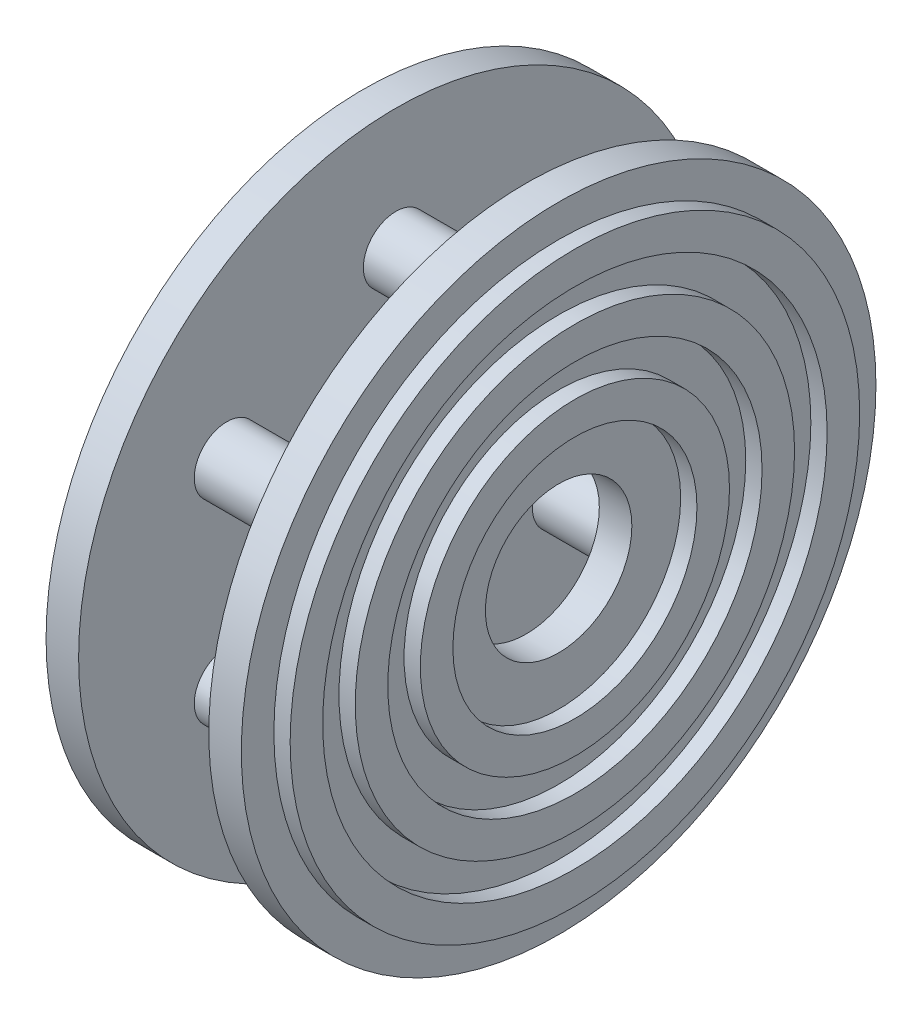
ISO-10303-21;
HEADER;
FILE_DESCRIPTION(('STEP AP214'),'2;1');
FILE_NAME('part.step','',(''),(''),'','','');
FILE_SCHEMA(('AUTOMOTIVE_DESIGN { 1 0 10303 214 1 1 1 1 }'));
ENDSEC;
DATA;
#1=APPLICATION_CONTEXT('core data for automotive mechanical design processes');
#2=APPLICATION_PROTOCOL_DEFINITION('international standard','automotive_design',2000,#1);
#3=PRODUCT_CONTEXT('',#1,'mechanical');
#4=PRODUCT('Part','Part','',(#3));
#5=PRODUCT_RELATED_PRODUCT_CATEGORY('part','',(#4));
#6=PRODUCT_DEFINITION_FORMATION('','',#4);
#7=PRODUCT_DEFINITION_CONTEXT('part definition',#1,'design');
#8=PRODUCT_DEFINITION('design','',#6,#7);
#9=PRODUCT_DEFINITION_SHAPE('','',#8);
#10=(LENGTH_UNIT() NAMED_UNIT(*) SI_UNIT(.MILLI.,.METRE.));
#11=(NAMED_UNIT(*) PLANE_ANGLE_UNIT() SI_UNIT($,.RADIAN.));
#12=(NAMED_UNIT(*) SI_UNIT($,.STERADIAN.) SOLID_ANGLE_UNIT());
#13=UNCERTAINTY_MEASURE_WITH_UNIT(LENGTH_MEASURE(1.E-05),#10,'distance_accuracy_value','');
#14=(GEOMETRIC_REPRESENTATION_CONTEXT(3) GLOBAL_UNCERTAINTY_ASSIGNED_CONTEXT((#13)) GLOBAL_UNIT_ASSIGNED_CONTEXT((#10,
#11,#12)) REPRESENTATION_CONTEXT('',''));
#15=CARTESIAN_POINT('',(0.,0.,0.));
#16=DIRECTION('',(0.,0.,1.));
#17=DIRECTION('',(1.,0.,0.));
#18=AXIS2_PLACEMENT_3D('',#15,#16,#17);
#19=CARTESIAN_POINT('',(1.,0.,0.));
#20=DIRECTION('',(1.,0.,0.));
#21=DIRECTION('',(0.,0.,-1.));
#22=AXIS2_PLACEMENT_3D('',#19,#20,#21);
#23=PLANE('',#22);
#24=CARTESIAN_POINT('',(1.,0.,0.));
#25=DIRECTION('',(1.,0.,0.));
#26=DIRECTION('',(0.,0.,-1.));
#27=AXIS2_PLACEMENT_3D('',#24,#25,#26);
#28=CIRCLE('',#27,2.25);
#29=CARTESIAN_POINT('',(1.,0.,-2.25));
#30=VERTEX_POINT('',#29);
#31=EDGE_CURVE('E90',#30,#30,#28,.T.);
#32=ORIENTED_EDGE('',*,*,#31,.F.);
#33=EDGE_LOOP('',(#32));
#34=FACE_BOUND('',#33,.T.);
#35=CARTESIAN_POINT('',(1.,0.,0.));
#36=DIRECTION('',(1.,0.,0.));
#37=DIRECTION('',(0.,0.,-1.));
#38=AXIS2_PLACEMENT_3D('',#35,#36,#37);
#39=CIRCLE('',#38,3.75);
#40=CARTESIAN_POINT('',(1.,0.,-3.75));
#41=VERTEX_POINT('',#40);
#42=EDGE_CURVE('E77',#41,#41,#39,.F.);
#43=ORIENTED_EDGE('',*,*,#42,.F.);
#44=EDGE_LOOP('',(#43));
#45=FACE_BOUND('',#44,.T.);
#46=ADVANCED_FACE('F51',(#34,#45),#23,.T.);
#47=CARTESIAN_POINT('',(1.,0.,0.));
#48=DIRECTION('',(1.,0.,0.));
#49=DIRECTION('',(0.,0.,-1.));
#50=AXIS2_PLACEMENT_3D('',#47,#48,#49);
#51=CIRCLE('',#50,4.75);
#52=CARTESIAN_POINT('',(1.,0.,-4.75));
#53=VERTEX_POINT('',#52);
#54=EDGE_CURVE('E117',#53,#53,#51,.T.);
#55=ORIENTED_EDGE('',*,*,#54,.F.);
#56=EDGE_LOOP('',(#55));
#57=FACE_BOUND('',#56,.T.);
#58=CARTESIAN_POINT('',(1.,0.,0.));
#59=DIRECTION('',(1.,0.,0.));
#60=DIRECTION('',(0.,0.,-1.));
#61=AXIS2_PLACEMENT_3D('',#58,#59,#60);
#62=CIRCLE('',#61,5.75);
#63=CARTESIAN_POINT('',(1.,0.,-5.75));
#64=VERTEX_POINT('',#63);
#65=EDGE_CURVE('E80',#64,#64,#62,.F.);
#66=ORIENTED_EDGE('',*,*,#65,.F.);
#67=EDGE_LOOP('',(#66));
#68=FACE_BOUND('',#67,.T.);
#69=ADVANCED_FACE('F177',(#57,#68),#23,.T.);
#70=CARTESIAN_POINT('',(1.,0.,0.));
#71=DIRECTION('',(1.,0.,0.));
#72=DIRECTION('',(0.,0.,-1.));
#73=AXIS2_PLACEMENT_3D('',#70,#71,#72);
#74=CIRCLE('',#73,6.75);
#75=CARTESIAN_POINT('',(1.,0.,-6.75));
#76=VERTEX_POINT('',#75);
#77=EDGE_CURVE('E108',#76,#76,#74,.T.);
#78=ORIENTED_EDGE('',*,*,#77,.F.);
#79=EDGE_LOOP('',(#78));
#80=FACE_BOUND('',#79,.T.);
#81=CARTESIAN_POINT('',(1.,0.,0.));
#82=DIRECTION('',(1.,0.,0.));
#83=DIRECTION('',(0.,0.,-1.));
#84=AXIS2_PLACEMENT_3D('',#81,#82,#83);
#85=CIRCLE('',#84,7.75);
#86=CARTESIAN_POINT('',(1.,0.,-7.75));
#87=VERTEX_POINT('',#86);
#88=EDGE_CURVE('E83',#87,#87,#85,.F.);
#89=ORIENTED_EDGE('',*,*,#88,.F.);
#90=EDGE_LOOP('',(#89));
#91=FACE_BOUND('',#90,.T.);
#92=ADVANCED_FACE('F184',(#80,#91),#23,.T.);
#93=CARTESIAN_POINT('',(1.,0.,0.));
#94=DIRECTION('',(1.,0.,0.));
#95=DIRECTION('',(0.,0.,-1.));
#96=AXIS2_PLACEMENT_3D('',#93,#94,#95);
#97=CIRCLE('',#96,8.75);
#98=CARTESIAN_POINT('',(1.,0.,-8.75));
#99=VERTEX_POINT('',#98);
#100=EDGE_CURVE('E99',#99,#99,#97,.T.);
#101=ORIENTED_EDGE('',*,*,#100,.F.);
#102=EDGE_LOOP('',(#101));
#103=FACE_BOUND('',#102,.T.);
#104=CARTESIAN_POINT('',(1.,0.,0.));
#105=DIRECTION('',(1.,0.,0.));
#106=DIRECTION('',(0.,0.,-1.));
#107=AXIS2_PLACEMENT_3D('',#104,#105,#106);
#108=CIRCLE('',#107,9.75);
#109=CARTESIAN_POINT('',(1.,0.,-9.75));
#110=VERTEX_POINT('',#109);
#111=EDGE_CURVE('E86',#110,#110,#108,.T.);
#112=ORIENTED_EDGE('',*,*,#111,.T.);
#113=EDGE_LOOP('',(#112));
#114=FACE_BOUND('',#113,.T.);
#115=ADVANCED_FACE('F180',(#103,#114),#23,.T.);
#116=CARTESIAN_POINT('',(0.,0.,0.));
#117=DIRECTION('',(1.,0.,0.));
#118=DIRECTION('',(0.,0.,-1.));
#119=AXIS2_PLACEMENT_3D('',#116,#117,#118);
#120=PLANE('',#119);
#121=CARTESIAN_POINT('',(0.,3.00000000000022,5.19615242270676));
#122=DIRECTION('',(1.,0.,0.));
#123=DIRECTION('',(0.,0.,-1.));
#124=AXIS2_PLACEMENT_3D('',#121,#122,#123);
#125=CIRCLE('',#124,1.00000000000007);
#126=CARTESIAN_POINT('',(0.,3.00000000000022,4.19615242270669));
#127=VERTEX_POINT('',#126);
#128=EDGE_CURVE('E11',#127,#127,#125,.F.);
#129=ORIENTED_EDGE('',*,*,#128,.F.);
#130=EDGE_LOOP('',(#129));
#131=FACE_BOUND('',#130,.T.);
#132=CARTESIAN_POINT('',(0.,-2.99999999999978,5.19615242270701));
#133=DIRECTION('',(1.,0.,0.));
#134=DIRECTION('',(0.,0.,-1.));
#135=AXIS2_PLACEMENT_3D('',#132,#133,#134);
#136=CIRCLE('',#135,1.00000000000033);
#137=CARTESIAN_POINT('',(0.,-2.99999999999978,4.19615242270669));
#138=VERTEX_POINT('',#137);
#139=EDGE_CURVE('E58',#138,#138,#136,.F.);
#140=ORIENTED_EDGE('',*,*,#139,.F.);
#141=EDGE_LOOP('',(#140));
#142=FACE_BOUND('',#141,.T.);
#143=CARTESIAN_POINT('',(0.,-6.,5.09386405508807E-13));
#144=DIRECTION('',(1.,0.,0.));
#145=DIRECTION('',(0.,0.,-1.));
#146=AXIS2_PLACEMENT_3D('',#143,#144,#145);
#147=CIRCLE('',#146,1.00000000000053);
#148=CARTESIAN_POINT('',(0.,-6.,-1.00000000000002));
#149=VERTEX_POINT('',#148);
#150=EDGE_CURVE('E62',#149,#149,#147,.F.);
#151=ORIENTED_EDGE('',*,*,#150,.F.);
#152=EDGE_LOOP('',(#151));
#153=FACE_BOUND('',#152,.T.);
#154=CARTESIAN_POINT('',(0.,-3.00000000000022,-5.19615242270625));
#155=DIRECTION('',(1.,0.,0.));
#156=DIRECTION('',(0.,0.,-1.));
#157=AXIS2_PLACEMENT_3D('',#154,#155,#156);
#158=CIRCLE('',#157,1.00000000000048);
#159=CARTESIAN_POINT('',(0.,-3.00000000000022,-6.19615242270674));
#160=VERTEX_POINT('',#159);
#161=EDGE_CURVE('E66',#160,#160,#158,.F.);
#162=ORIENTED_EDGE('',*,*,#161,.F.);
#163=EDGE_LOOP('',(#162));
#164=FACE_BOUND('',#163,.T.);
#165=CARTESIAN_POINT('',(0.,2.99999999999978,-5.19615242270651));
#166=DIRECTION('',(1.,0.,0.));
#167=DIRECTION('',(0.,0.,-1.));
#168=AXIS2_PLACEMENT_3D('',#165,#166,#167);
#169=CIRCLE('',#168,1.00000000000026);
#170=CARTESIAN_POINT('',(0.,2.99999999999978,-6.19615242270677));
#171=VERTEX_POINT('',#170);
#172=EDGE_CURVE('E71',#171,#171,#169,.F.);
#173=ORIENTED_EDGE('',*,*,#172,.F.);
#174=EDGE_LOOP('',(#173));
#175=FACE_BOUND('',#174,.T.);
#176=CARTESIAN_POINT('',(0.,6.,0.));
#177=DIRECTION('',(1.,0.,0.));
#178=DIRECTION('',(0.,0.,-1.));
#179=AXIS2_PLACEMENT_3D('',#176,#177,#178);
#180=CIRCLE('',#179,1.);
#181=CARTESIAN_POINT('',(0.,6.,-1.));
#182=VERTEX_POINT('',#181);
#183=EDGE_CURVE('E74',#182,#182,#180,.F.);
#184=ORIENTED_EDGE('',*,*,#183,.F.);
#185=EDGE_LOOP('',(#184));
#186=FACE_BOUND('',#185,.T.);
#187=CARTESIAN_POINT('',(0.,0.,0.));
#188=DIRECTION('',(1.,0.,0.));
#189=DIRECTION('',(0.,0.,-1.));
#190=AXIS2_PLACEMENT_3D('',#187,#188,#189);
#191=CIRCLE('',#190,9.75);
#192=CARTESIAN_POINT('',(0.,0.,-9.75));
#193=VERTEX_POINT('',#192);
#194=EDGE_CURVE('E87',#193,#193,#191,.T.);
#195=ORIENTED_EDGE('',*,*,#194,.F.);
#196=EDGE_LOOP('',(#195));
#197=FACE_BOUND('',#196,.T.);
#198=CARTESIAN_POINT('',(0.,0.,0.));
#199=DIRECTION('',(1.,0.,0.));
#200=DIRECTION('',(0.,0.,-1.));
#201=AXIS2_PLACEMENT_3D('',#198,#199,#200);
#202=CIRCLE('',#201,2.25);
#203=CARTESIAN_POINT('',(0.,0.,-2.25));
#204=VERTEX_POINT('',#203);
#205=EDGE_CURVE('E93',#204,#204,#202,.T.);
#206=ORIENTED_EDGE('',*,*,#205,.T.);
#207=EDGE_LOOP('',(#206));
#208=FACE_BOUND('',#207,.T.);
#209=ADVANCED_FACE('F190',(#131,#142,#153,#164,#175,#186,#197,#208),#120,.F.);
#210=CARTESIAN_POINT('',(1.,0.,0.));
#211=DIRECTION('',(-1.,0.,0.));
#212=DIRECTION('',(0.,0.,1.));
#213=AXIS2_PLACEMENT_3D('',#210,#211,#212);
#214=CYLINDRICAL_SURFACE('',#213,9.75);
#215=ORIENTED_EDGE('',*,*,#111,.F.);
#216=EDGE_LOOP('',(#215));
#217=FACE_BOUND('',#216,.T.);
#218=ORIENTED_EDGE('',*,*,#194,.T.);
#219=EDGE_LOOP('',(#218));
#220=FACE_BOUND('',#219,.T.);
#221=ADVANCED_FACE('F53',(#217,#220),#214,.T.);
#222=CARTESIAN_POINT('',(1.,0.,0.));
#223=DIRECTION('',(-1.,0.,0.));
#224=DIRECTION('',(0.,0.,1.));
#225=AXIS2_PLACEMENT_3D('',#222,#223,#224);
#226=CYLINDRICAL_SURFACE('',#225,2.25);
#227=ORIENTED_EDGE('',*,*,#31,.T.);
#228=EDGE_LOOP('',(#227));
#229=FACE_BOUND('',#228,.T.);
#230=ORIENTED_EDGE('',*,*,#205,.F.);
#231=EDGE_LOOP('',(#230));
#232=FACE_BOUND('',#231,.T.);
#233=ADVANCED_FACE('F204',(#229,#232),#226,.F.);
#234=CARTESIAN_POINT('',(1.5,0.,0.));
#235=DIRECTION('',(-1.,0.,0.));
#236=DIRECTION('',(0.,0.,1.));
#237=AXIS2_PLACEMENT_3D('',#234,#235,#236);
#238=CYLINDRICAL_SURFACE('',#237,7.75);
#239=CARTESIAN_POINT('',(1.5,0.,0.));
#240=DIRECTION('',(1.,0.,0.));
#241=DIRECTION('',(0.,0.,-1.));
#242=AXIS2_PLACEMENT_3D('',#239,#240,#241);
#243=CIRCLE('',#242,7.75);
#244=CARTESIAN_POINT('',(1.5,0.,-7.75));
#245=VERTEX_POINT('',#244);
#246=EDGE_CURVE('E102',#245,#245,#243,.T.);
#247=ORIENTED_EDGE('',*,*,#246,.T.);
#248=EDGE_LOOP('',(#247));
#249=FACE_BOUND('',#248,.T.);
#250=ORIENTED_EDGE('',*,*,#88,.T.);
#251=EDGE_LOOP('',(#250));
#252=FACE_BOUND('',#251,.T.);
#253=ADVANCED_FACE('F211',(#249,#252),#238,.F.);
#254=CARTESIAN_POINT('',(1.5,0.,0.));
#255=DIRECTION('',(-1.,0.,0.));
#256=DIRECTION('',(0.,0.,1.));
#257=AXIS2_PLACEMENT_3D('',#254,#255,#256);
#258=CYLINDRICAL_SURFACE('',#257,8.75);
#259=CARTESIAN_POINT('',(1.5,0.,0.));
#260=DIRECTION('',(1.,0.,0.));
#261=DIRECTION('',(0.,0.,-1.));
#262=AXIS2_PLACEMENT_3D('',#259,#260,#261);
#263=CIRCLE('',#262,8.75);
#264=CARTESIAN_POINT('',(1.5,0.,-8.75));
#265=VERTEX_POINT('',#264);
#266=EDGE_CURVE('E96',#265,#265,#263,.T.);
#267=ORIENTED_EDGE('',*,*,#266,.F.);
#268=EDGE_LOOP('',(#267));
#269=FACE_BOUND('',#268,.T.);
#270=ORIENTED_EDGE('',*,*,#100,.T.);
#271=EDGE_LOOP('',(#270));
#272=FACE_BOUND('',#271,.T.);
#273=ADVANCED_FACE('F216',(#269,#272),#258,.T.);
#274=CARTESIAN_POINT('',(1.5,0.,0.));
#275=DIRECTION('',(1.,0.,0.));
#276=DIRECTION('',(0.,0.,-1.));
#277=AXIS2_PLACEMENT_3D('',#274,#275,#276);
#278=PLANE('',#277);
#279=ORIENTED_EDGE('',*,*,#246,.F.);
#280=EDGE_LOOP('',(#279));
#281=FACE_BOUND('',#280,.T.);
#282=ORIENTED_EDGE('',*,*,#266,.T.);
#283=EDGE_LOOP('',(#282));
#284=FACE_BOUND('',#283,.T.);
#285=ADVANCED_FACE('F222',(#281,#284),#278,.T.);
#286=CARTESIAN_POINT('',(1.5,0.,0.));
#287=DIRECTION('',(-1.,0.,0.));
#288=DIRECTION('',(0.,0.,1.));
#289=AXIS2_PLACEMENT_3D('',#286,#287,#288);
#290=CYLINDRICAL_SURFACE('',#289,5.75);
#291=CARTESIAN_POINT('',(1.5,0.,0.));
#292=DIRECTION('',(1.,0.,0.));
#293=DIRECTION('',(0.,0.,-1.));
#294=AXIS2_PLACEMENT_3D('',#291,#292,#293);
#295=CIRCLE('',#294,5.75);
#296=CARTESIAN_POINT('',(1.5,0.,-5.75));
#297=VERTEX_POINT('',#296);
#298=EDGE_CURVE('E111',#297,#297,#295,.T.);
#299=ORIENTED_EDGE('',*,*,#298,.T.);
#300=EDGE_LOOP('',(#299));
#301=FACE_BOUND('',#300,.T.);
#302=ORIENTED_EDGE('',*,*,#65,.T.);
#303=EDGE_LOOP('',(#302));
#304=FACE_BOUND('',#303,.T.);
#305=ADVANCED_FACE('F226',(#301,#304),#290,.F.);
#306=CARTESIAN_POINT('',(1.5,0.,0.));
#307=DIRECTION('',(-1.,0.,0.));
#308=DIRECTION('',(0.,0.,1.));
#309=AXIS2_PLACEMENT_3D('',#306,#307,#308);
#310=CYLINDRICAL_SURFACE('',#309,6.75);
#311=CARTESIAN_POINT('',(1.5,0.,0.));
#312=DIRECTION('',(1.,0.,0.));
#313=DIRECTION('',(0.,0.,-1.));
#314=AXIS2_PLACEMENT_3D('',#311,#312,#313);
#315=CIRCLE('',#314,6.75);
#316=CARTESIAN_POINT('',(1.5,0.,-6.75));
#317=VERTEX_POINT('',#316);
#318=EDGE_CURVE('E103',#317,#317,#315,.T.);
#319=ORIENTED_EDGE('',*,*,#318,.F.);
#320=EDGE_LOOP('',(#319));
#321=FACE_BOUND('',#320,.T.);
#322=ORIENTED_EDGE('',*,*,#77,.T.);
#323=EDGE_LOOP('',(#322));
#324=FACE_BOUND('',#323,.T.);
#325=ADVANCED_FACE('F230',(#321,#324),#310,.T.);
#326=CARTESIAN_POINT('',(1.5,0.,0.));
#327=DIRECTION('',(1.,0.,0.));
#328=DIRECTION('',(0.,0.,-1.));
#329=AXIS2_PLACEMENT_3D('',#326,#327,#328);
#330=PLANE('',#329);
#331=ORIENTED_EDGE('',*,*,#298,.F.);
#332=EDGE_LOOP('',(#331));
#333=FACE_BOUND('',#332,.T.);
#334=ORIENTED_EDGE('',*,*,#318,.T.);
#335=EDGE_LOOP('',(#334));
#336=FACE_BOUND('',#335,.T.);
#337=ADVANCED_FACE('F234',(#333,#336),#330,.T.);
#338=CARTESIAN_POINT('',(1.5,0.,0.));
#339=DIRECTION('',(-1.,0.,0.));
#340=DIRECTION('',(0.,0.,1.));
#341=AXIS2_PLACEMENT_3D('',#338,#339,#340);
#342=CYLINDRICAL_SURFACE('',#341,3.75);
#343=CARTESIAN_POINT('',(1.5,0.,0.));
#344=DIRECTION('',(1.,0.,0.));
#345=DIRECTION('',(0.,0.,-1.));
#346=AXIS2_PLACEMENT_3D('',#343,#344,#345);
#347=CIRCLE('',#346,3.75);
#348=CARTESIAN_POINT('',(1.5,0.,-3.75));
#349=VERTEX_POINT('',#348);
#350=EDGE_CURVE('E120',#349,#349,#347,.T.);
#351=ORIENTED_EDGE('',*,*,#350,.T.);
#352=EDGE_LOOP('',(#351));
#353=FACE_BOUND('',#352,.T.);
#354=ORIENTED_EDGE('',*,*,#42,.T.);
#355=EDGE_LOOP('',(#354));
#356=FACE_BOUND('',#355,.T.);
#357=ADVANCED_FACE('F238',(#353,#356),#342,.F.);
#358=CARTESIAN_POINT('',(1.5,0.,0.));
#359=DIRECTION('',(-1.,0.,0.));
#360=DIRECTION('',(0.,0.,1.));
#361=AXIS2_PLACEMENT_3D('',#358,#359,#360);
#362=CYLINDRICAL_SURFACE('',#361,4.75);
#363=CARTESIAN_POINT('',(1.5,0.,0.));
#364=DIRECTION('',(1.,0.,0.));
#365=DIRECTION('',(0.,0.,-1.));
#366=AXIS2_PLACEMENT_3D('',#363,#364,#365);
#367=CIRCLE('',#366,4.75);
#368=CARTESIAN_POINT('',(1.5,0.,-4.75));
#369=VERTEX_POINT('',#368);
#370=EDGE_CURVE('E112',#369,#369,#367,.T.);
#371=ORIENTED_EDGE('',*,*,#370,.F.);
#372=EDGE_LOOP('',(#371));
#373=FACE_BOUND('',#372,.T.);
#374=ORIENTED_EDGE('',*,*,#54,.T.);
#375=EDGE_LOOP('',(#374));
#376=FACE_BOUND('',#375,.T.);
#377=ADVANCED_FACE('F242',(#373,#376),#362,.T.);
#378=CARTESIAN_POINT('',(1.5,0.,0.));
#379=DIRECTION('',(1.,0.,0.));
#380=DIRECTION('',(0.,0.,-1.));
#381=AXIS2_PLACEMENT_3D('',#378,#379,#380);
#382=PLANE('',#381);
#383=ORIENTED_EDGE('',*,*,#350,.F.);
#384=EDGE_LOOP('',(#383));
#385=FACE_BOUND('',#384,.T.);
#386=ORIENTED_EDGE('',*,*,#370,.T.);
#387=EDGE_LOOP('',(#386));
#388=FACE_BOUND('',#387,.T.);
#389=ADVANCED_FACE('F246',(#385,#388),#382,.T.);
#390=CARTESIAN_POINT('',(-4.,6.,0.));
#391=DIRECTION('',(1.,0.,0.));
#392=DIRECTION('',(0.,0.,-1.));
#393=AXIS2_PLACEMENT_3D('',#390,#391,#392);
#394=CYLINDRICAL_SURFACE('',#393,1.);
#395=CARTESIAN_POINT('',(-4.,6.,0.));
#396=DIRECTION('',(-1.,0.,0.));
#397=DIRECTION('',(0.,0.,1.));
#398=AXIS2_PLACEMENT_3D('',#395,#396,#397);
#399=CIRCLE('',#398,1.);
#400=CARTESIAN_POINT('',(-4.,6.,1.));
#401=VERTEX_POINT('',#400);
#402=EDGE_CURVE('E121',#401,#401,#399,.T.);
#403=ORIENTED_EDGE('',*,*,#402,.F.);
#404=EDGE_LOOP('',(#403));
#405=FACE_BOUND('',#404,.T.);
#406=ORIENTED_EDGE('',*,*,#183,.T.);
#407=EDGE_LOOP('',(#406));
#408=FACE_BOUND('',#407,.T.);
#409=ADVANCED_FACE('F250',(#405,#408),#394,.T.);
#410=CARTESIAN_POINT('',(-4.,2.99999999999978,-5.19615242270651));
#411=DIRECTION('',(1.,0.,0.));
#412=DIRECTION('',(0.,0.,-1.));
#413=AXIS2_PLACEMENT_3D('',#410,#411,#412);
#414=CYLINDRICAL_SURFACE('',#413,1.00000000000026);
#415=CARTESIAN_POINT('',(-4.,2.99999999999978,-5.19615242270651));
#416=DIRECTION('',(-1.,0.,0.));
#417=DIRECTION('',(0.,0.,1.));
#418=AXIS2_PLACEMENT_3D('',#415,#416,#417);
#419=CIRCLE('',#418,1.00000000000026);
#420=CARTESIAN_POINT('',(-4.,2.99999999999978,-4.19615242270625));
#421=VERTEX_POINT('',#420);
#422=EDGE_CURVE('E128',#421,#421,#419,.T.);
#423=ORIENTED_EDGE('',*,*,#422,.F.);
#424=EDGE_LOOP('',(#423));
#425=FACE_BOUND('',#424,.T.);
#426=ORIENTED_EDGE('',*,*,#172,.T.);
#427=EDGE_LOOP('',(#426));
#428=FACE_BOUND('',#427,.T.);
#429=ADVANCED_FACE('F254',(#425,#428),#414,.T.);
#430=CARTESIAN_POINT('',(-4.,-3.00000000000022,-5.19615242270625));
#431=DIRECTION('',(1.,0.,0.));
#432=DIRECTION('',(0.,0.,-1.));
#433=AXIS2_PLACEMENT_3D('',#430,#431,#432);
#434=CYLINDRICAL_SURFACE('',#433,1.00000000000048);
#435=CARTESIAN_POINT('',(-4.,-3.00000000000022,-5.19615242270625));
#436=DIRECTION('',(-1.,0.,0.));
#437=DIRECTION('',(0.,0.,1.));
#438=AXIS2_PLACEMENT_3D('',#435,#436,#437);
#439=CIRCLE('',#438,1.00000000000048);
#440=CARTESIAN_POINT('',(-4.,-3.00000000000022,-4.19615242270577));
#441=VERTEX_POINT('',#440);
#442=EDGE_CURVE('E131',#441,#441,#439,.T.);
#443=ORIENTED_EDGE('',*,*,#442,.F.);
#444=EDGE_LOOP('',(#443));
#445=FACE_BOUND('',#444,.T.);
#446=ORIENTED_EDGE('',*,*,#161,.T.);
#447=EDGE_LOOP('',(#446));
#448=FACE_BOUND('',#447,.T.);
#449=ADVANCED_FACE('F258',(#445,#448),#434,.T.);
#450=CARTESIAN_POINT('',(-4.,-6.,5.09386405508807E-13));
#451=DIRECTION('',(1.,0.,0.));
#452=DIRECTION('',(0.,0.,-1.));
#453=AXIS2_PLACEMENT_3D('',#450,#451,#452);
#454=CYLINDRICAL_SURFACE('',#453,1.00000000000053);
#455=CARTESIAN_POINT('',(-4.,-6.,5.09386405508807E-13));
#456=DIRECTION('',(-1.,0.,0.));
#457=DIRECTION('',(0.,0.,1.));
#458=AXIS2_PLACEMENT_3D('',#455,#456,#457);
#459=CIRCLE('',#458,1.00000000000053);
#460=CARTESIAN_POINT('',(-4.,-6.,1.00000000000104));
#461=VERTEX_POINT('',#460);
#462=EDGE_CURVE('E134',#461,#461,#459,.T.);
#463=ORIENTED_EDGE('',*,*,#462,.F.);
#464=EDGE_LOOP('',(#463));
#465=FACE_BOUND('',#464,.T.);
#466=ORIENTED_EDGE('',*,*,#150,.T.);
#467=EDGE_LOOP('',(#466));
#468=FACE_BOUND('',#467,.T.);
#469=ADVANCED_FACE('F262',(#465,#468),#454,.T.);
#470=CARTESIAN_POINT('',(-4.,-2.99999999999978,5.19615242270701));
#471=DIRECTION('',(1.,0.,0.));
#472=DIRECTION('',(0.,0.,-1.));
#473=AXIS2_PLACEMENT_3D('',#470,#471,#472);
#474=CYLINDRICAL_SURFACE('',#473,1.00000000000033);
#475=CARTESIAN_POINT('',(-4.,-2.99999999999978,5.19615242270701));
#476=DIRECTION('',(-1.,0.,0.));
#477=DIRECTION('',(0.,0.,1.));
#478=AXIS2_PLACEMENT_3D('',#475,#476,#477);
#479=CIRCLE('',#478,1.00000000000033);
#480=CARTESIAN_POINT('',(-4.,-2.99999999999978,6.19615242270734));
#481=VERTEX_POINT('',#480);
#482=EDGE_CURVE('E137',#481,#481,#479,.T.);
#483=ORIENTED_EDGE('',*,*,#482,.F.);
#484=EDGE_LOOP('',(#483));
#485=FACE_BOUND('',#484,.T.);
#486=ORIENTED_EDGE('',*,*,#139,.T.);
#487=EDGE_LOOP('',(#486));
#488=FACE_BOUND('',#487,.T.);
#489=ADVANCED_FACE('F172',(#485,#488),#474,.T.);
#490=CARTESIAN_POINT('',(-4.,3.00000000000022,5.19615242270676));
#491=DIRECTION('',(1.,0.,0.));
#492=DIRECTION('',(0.,0.,-1.));
#493=AXIS2_PLACEMENT_3D('',#490,#491,#492);
#494=CYLINDRICAL_SURFACE('',#493,1.00000000000007);
#495=CARTESIAN_POINT('',(-4.,3.00000000000022,5.19615242270676));
#496=DIRECTION('',(-1.,0.,0.));
#497=DIRECTION('',(0.,0.,1.));
#498=AXIS2_PLACEMENT_3D('',#495,#496,#497);
#499=CIRCLE('',#498,1.00000000000007);
#500=CARTESIAN_POINT('',(-4.,3.00000000000022,6.19615242270683));
#501=VERTEX_POINT('',#500);
#502=EDGE_CURVE('E140',#501,#501,#499,.T.);
#503=ORIENTED_EDGE('',*,*,#502,.F.);
#504=EDGE_LOOP('',(#503));
#505=FACE_BOUND('',#504,.T.);
#506=ORIENTED_EDGE('',*,*,#128,.T.);
#507=EDGE_LOOP('',(#506));
#508=FACE_BOUND('',#507,.T.);
#509=ADVANCED_FACE('F162',(#505,#508),#494,.T.);
#510=CARTESIAN_POINT('',(-5.,0.,0.));
#511=DIRECTION('',(-1.,0.,0.));
#512=DIRECTION('',(0.,0.,1.));
#513=AXIS2_PLACEMENT_3D('',#510,#511,#512);
#514=PLANE('',#513);
#515=CARTESIAN_POINT('',(-5.,0.,0.));
#516=DIRECTION('',(-1.,0.,0.));
#517=DIRECTION('',(0.,0.,1.));
#518=AXIS2_PLACEMENT_3D('',#515,#516,#517);
#519=CIRCLE('',#518,9.75);
#520=CARTESIAN_POINT('',(-5.,0.,9.75));
#521=VERTEX_POINT('',#520);
#522=EDGE_CURVE('E143',#521,#521,#519,.T.);
#523=ORIENTED_EDGE('',*,*,#522,.T.);
#524=EDGE_LOOP('',(#523));
#525=FACE_BOUND('',#524,.T.);
#526=CARTESIAN_POINT('',(-5.,0.,0.));
#527=DIRECTION('',(-1.,0.,0.));
#528=DIRECTION('',(0.,0.,1.));
#529=AXIS2_PLACEMENT_3D('',#526,#527,#528);
#530=CIRCLE('',#529,2.25);
#531=CARTESIAN_POINT('',(-5.,0.,2.25));
#532=VERTEX_POINT('',#531);
#533=EDGE_CURVE('E147',#532,#532,#530,.T.);
#534=ORIENTED_EDGE('',*,*,#533,.F.);
#535=EDGE_LOOP('',(#534));
#536=FACE_BOUND('',#535,.T.);
#537=ADVANCED_FACE('F159',(#525,#536),#514,.T.);
#538=CARTESIAN_POINT('',(-4.,0.,0.));
#539=DIRECTION('',(-1.,0.,0.));
#540=DIRECTION('',(0.,0.,1.));
#541=AXIS2_PLACEMENT_3D('',#538,#539,#540);
#542=PLANE('',#541);
#543=ORIENTED_EDGE('',*,*,#402,.T.);
#544=EDGE_LOOP('',(#543));
#545=FACE_BOUND('',#544,.T.);
#546=ORIENTED_EDGE('',*,*,#422,.T.);
#547=EDGE_LOOP('',(#546));
#548=FACE_BOUND('',#547,.T.);
#549=ORIENTED_EDGE('',*,*,#442,.T.);
#550=EDGE_LOOP('',(#549));
#551=FACE_BOUND('',#550,.T.);
#552=ORIENTED_EDGE('',*,*,#462,.T.);
#553=EDGE_LOOP('',(#552));
#554=FACE_BOUND('',#553,.T.);
#555=ORIENTED_EDGE('',*,*,#482,.T.);
#556=EDGE_LOOP('',(#555));
#557=FACE_BOUND('',#556,.T.);
#558=ORIENTED_EDGE('',*,*,#502,.T.);
#559=EDGE_LOOP('',(#558));
#560=FACE_BOUND('',#559,.T.);
#561=CARTESIAN_POINT('',(-4.,0.,0.));
#562=DIRECTION('',(-1.,0.,0.));
#563=DIRECTION('',(0.,0.,1.));
#564=AXIS2_PLACEMENT_3D('',#561,#562,#563);
#565=CIRCLE('',#564,9.75);
#566=CARTESIAN_POINT('',(-4.,0.,9.75));
#567=VERTEX_POINT('',#566);
#568=EDGE_CURVE('E144',#567,#567,#565,.T.);
#569=ORIENTED_EDGE('',*,*,#568,.F.);
#570=EDGE_LOOP('',(#569));
#571=FACE_BOUND('',#570,.T.);
#572=CARTESIAN_POINT('',(-4.,0.,0.));
#573=DIRECTION('',(-1.,0.,0.));
#574=DIRECTION('',(0.,0.,1.));
#575=AXIS2_PLACEMENT_3D('',#572,#573,#574);
#576=CIRCLE('',#575,2.25);
#577=CARTESIAN_POINT('',(-4.,0.,2.25));
#578=VERTEX_POINT('',#577);
#579=EDGE_CURVE('E150',#578,#578,#576,.T.);
#580=ORIENTED_EDGE('',*,*,#579,.T.);
#581=EDGE_LOOP('',(#580));
#582=FACE_BOUND('',#581,.T.);
#583=ADVANCED_FACE('F161',(#545,#548,#551,#554,#557,#560,#571,#582),#542,.F.);
#584=CARTESIAN_POINT('',(-5.,0.,0.));
#585=DIRECTION('',(1.,0.,0.));
#586=DIRECTION('',(0.,0.,-1.));
#587=AXIS2_PLACEMENT_3D('',#584,#585,#586);
#588=CYLINDRICAL_SURFACE('',#587,9.75);
#589=ORIENTED_EDGE('',*,*,#522,.F.);
#590=EDGE_LOOP('',(#589));
#591=FACE_BOUND('',#590,.T.);
#592=ORIENTED_EDGE('',*,*,#568,.T.);
#593=EDGE_LOOP('',(#592));
#594=FACE_BOUND('',#593,.T.);
#595=ADVANCED_FACE('F169',(#591,#594),#588,.T.);
#596=CARTESIAN_POINT('',(-5.,0.,0.));
#597=DIRECTION('',(1.,0.,0.));
#598=DIRECTION('',(0.,0.,-1.));
#599=AXIS2_PLACEMENT_3D('',#596,#597,#598);
#600=CYLINDRICAL_SURFACE('',#599,2.25);
#601=ORIENTED_EDGE('',*,*,#533,.T.);
#602=EDGE_LOOP('',(#601));
#603=FACE_BOUND('',#602,.T.);
#604=ORIENTED_EDGE('',*,*,#579,.F.);
#605=EDGE_LOOP('',(#604));
#606=FACE_BOUND('',#605,.T.);
#607=ADVANCED_FACE('F156',(#603,#606),#600,.F.);
#608=CLOSED_SHELL('',(#46,#69,#92,#115,#209,#221,#233,#253,#273,#285,#305,#325,#337,#357,#377,
#389,#409,#429,#449,#469,#489,#509,#537,#583,#595,#607));
#609=MANIFOLD_SOLID_BREP('B2',#608);
#610=ADVANCED_BREP_SHAPE_REPRESENTATION('',(#18,#609),#14);
#611=SHAPE_DEFINITION_REPRESENTATION(#9,#610);
ENDSEC;
END-ISO-10303-21;
